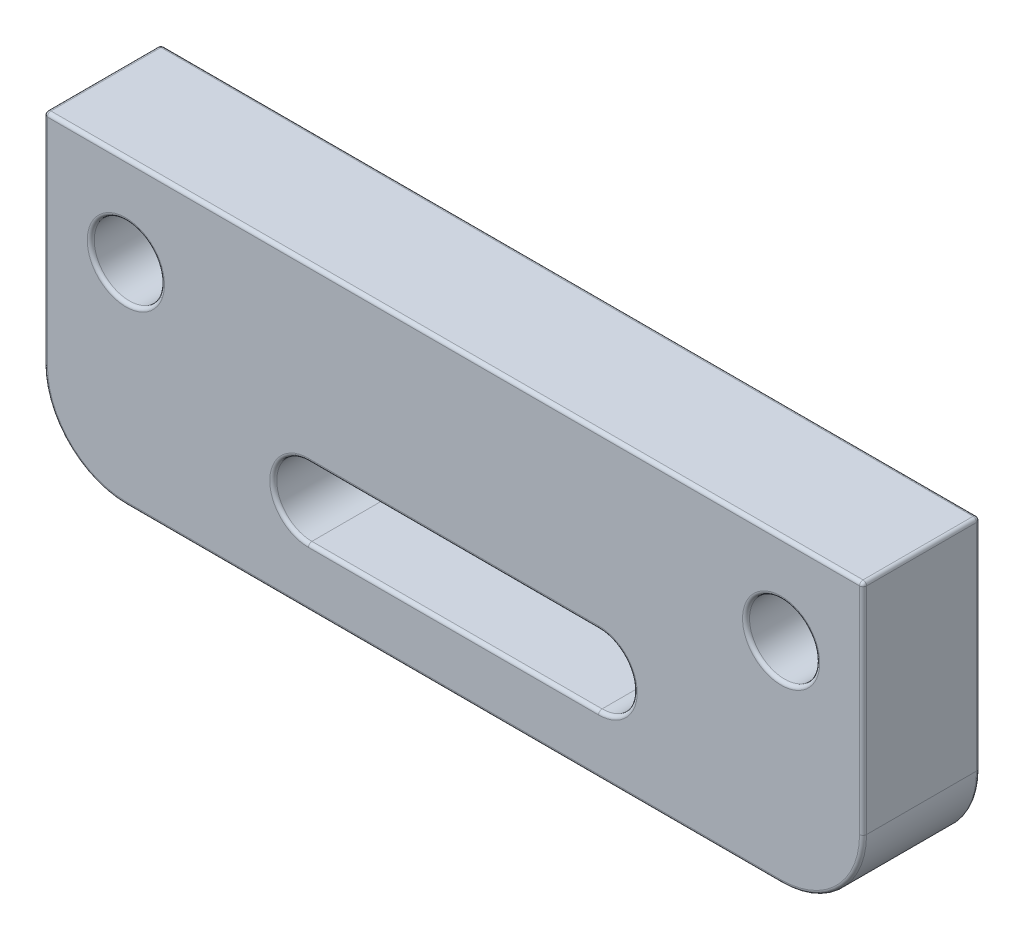
ISO-10303-21;
HEADER;
FILE_DESCRIPTION(('STEP AP214'),'2;1');
FILE_NAME('part.step','',(''),(''),'','','');
FILE_SCHEMA(('AUTOMOTIVE_DESIGN { 1 0 10303 214 1 1 1 1 }'));
ENDSEC;
DATA;
#1=APPLICATION_CONTEXT('core data for automotive mechanical design processes');
#2=APPLICATION_PROTOCOL_DEFINITION('international standard','automotive_design',2000,#1);
#3=PRODUCT_CONTEXT('',#1,'mechanical');
#4=PRODUCT('Part','Part','',(#3));
#5=PRODUCT_RELATED_PRODUCT_CATEGORY('part','',(#4));
#6=PRODUCT_DEFINITION_FORMATION('','',#4);
#7=PRODUCT_DEFINITION_CONTEXT('part definition',#1,'design');
#8=PRODUCT_DEFINITION('design','',#6,#7);
#9=PRODUCT_DEFINITION_SHAPE('','',#8);
#10=(LENGTH_UNIT() NAMED_UNIT(*) SI_UNIT(.MILLI.,.METRE.));
#11=(NAMED_UNIT(*) PLANE_ANGLE_UNIT() SI_UNIT($,.RADIAN.));
#12=(NAMED_UNIT(*) SI_UNIT($,.STERADIAN.) SOLID_ANGLE_UNIT());
#13=UNCERTAINTY_MEASURE_WITH_UNIT(LENGTH_MEASURE(1.E-05),#10,'distance_accuracy_value','');
#14=(GEOMETRIC_REPRESENTATION_CONTEXT(3) GLOBAL_UNCERTAINTY_ASSIGNED_CONTEXT((#13)) GLOBAL_UNIT_ASSIGNED_CONTEXT((#10,
#11,#12)) REPRESENTATION_CONTEXT('',''));
#15=CARTESIAN_POINT('',(0.,0.,0.));
#16=DIRECTION('',(0.,0.,1.));
#17=DIRECTION('',(1.,0.,0.));
#18=AXIS2_PLACEMENT_3D('',#15,#16,#17);
#19=CARTESIAN_POINT('',(-22.35,-6.15,82.5970196391225));
#20=DIRECTION('',(0.,1.,0.));
#21=DIRECTION('',(-1.,0.,0.));
#22=AXIS2_PLACEMENT_3D('',#19,#20,#21);
#23=PLANE('',#22);
#24=DIRECTION('',(-1.,0.,0.));
#25=VECTOR('',#24,1.);
#26=CARTESIAN_POINT('',(-22.35,-6.15,4.85000000000001));
#27=LINE('',#26,#25);
#28=CARTESIAN_POINT('',(-17.35,-6.15,4.85));
#29=VERTEX_POINT('',#28);
#30=CARTESIAN_POINT('',(17.35,-6.15,4.85));
#31=VERTEX_POINT('',#30);
#32=EDGE_CURVE('E416',#29,#31,#27,.F.);
#33=ORIENTED_EDGE('',*,*,#32,.T.);
#34=DIRECTION('',(0.,0.,1.));
#35=VECTOR('',#34,1.);
#36=CARTESIAN_POINT('',(17.35,-6.15,82.5970196391225));
#37=LINE('',#36,#35);
#38=CARTESIAN_POINT('',(17.35,-6.15,0.15));
#39=VERTEX_POINT('',#38);
#40=EDGE_CURVE('E425',#31,#39,#37,.F.);
#41=ORIENTED_EDGE('',*,*,#40,.T.);
#42=DIRECTION('',(1.,0.,0.));
#43=VECTOR('',#42,1.);
#44=CARTESIAN_POINT('',(-17.35,-6.15,0.15));
#45=LINE('',#44,#43);
#46=CARTESIAN_POINT('',(-17.35,-6.15,0.15));
#47=VERTEX_POINT('',#46);
#48=EDGE_CURVE('E422',#39,#47,#45,.F.);
#49=ORIENTED_EDGE('',*,*,#48,.T.);
#50=DIRECTION('',(0.,0.,1.));
#51=VECTOR('',#50,1.);
#52=CARTESIAN_POINT('',(-17.35,-6.15,4.85000000000001));
#53=LINE('',#52,#51);
#54=EDGE_CURVE('E419',#47,#29,#53,.T.);
#55=ORIENTED_EDGE('',*,*,#54,.T.);
#56=EDGE_LOOP('',(#33,#41,#49,#55));
#57=FACE_BOUND('',#56,.T.);
#58=ADVANCED_FACE('F40',(#57),#23,.T.);
#59=CARTESIAN_POINT('',(-17.5,0.,5.));
#60=DIRECTION('',(1.,0.,0.));
#61=DIRECTION('',(0.,1.,0.));
#62=AXIS2_PLACEMENT_3D('',#59,#60,#61);
#63=PLANE('',#62);
#64=DIRECTION('',(0.,-1.,0.));
#65=VECTOR('',#64,1.);
#66=CARTESIAN_POINT('',(-17.5,9.,4.85));
#67=LINE('',#66,#65);
#68=CARTESIAN_POINT('',(-17.5,-15.5,4.85));
#69=VERTEX_POINT('',#68);
#70=CARTESIAN_POINT('',(-17.5,-6.3,4.85));
#71=VERTEX_POINT('',#70);
#72=EDGE_CURVE('E303',#69,#71,#67,.F.);
#73=ORIENTED_EDGE('',*,*,#72,.T.);
#74=DIRECTION('',(0.,0.,1.));
#75=VECTOR('',#74,1.);
#76=CARTESIAN_POINT('',(-17.5,-6.3,0.149999999999997));
#77=LINE('',#76,#75);
#78=CARTESIAN_POINT('',(-17.5,-6.3,0.15));
#79=VERTEX_POINT('',#78);
#80=EDGE_CURVE('E438',#71,#79,#77,.F.);
#81=ORIENTED_EDGE('',*,*,#80,.T.);
#82=DIRECTION('',(0.,-1.,0.));
#83=VECTOR('',#82,1.);
#84=CARTESIAN_POINT('',(-17.5,0.,0.15));
#85=LINE('',#84,#83);
#86=CARTESIAN_POINT('',(-17.5,-15.5,0.15));
#87=VERTEX_POINT('',#86);
#88=EDGE_CURVE('E306',#79,#87,#85,.T.);
#89=ORIENTED_EDGE('',*,*,#88,.T.);
#90=DIRECTION('',(0.,0.,-1.));
#91=VECTOR('',#90,1.);
#92=CARTESIAN_POINT('',(-17.5,-15.5,5.));
#93=LINE('',#92,#91);
#94=EDGE_CURVE('E538',#87,#69,#93,.F.);
#95=ORIENTED_EDGE('',*,*,#94,.T.);
#96=EDGE_LOOP('',(#73,#81,#89,#95));
#97=FACE_BOUND('',#96,.T.);
#98=ADVANCED_FACE('F541',(#97),#63,.F.);
#99=CARTESIAN_POINT('',(17.5,0.,5.));
#100=DIRECTION('',(1.,0.,0.));
#101=DIRECTION('',(0.,1.,0.));
#102=AXIS2_PLACEMENT_3D('',#99,#100,#101);
#103=PLANE('',#102);
#104=DIRECTION('',(0.,-1.,0.));
#105=VECTOR('',#104,1.);
#106=CARTESIAN_POINT('',(17.5,9.00000000000001,0.15));
#107=LINE('',#106,#105);
#108=CARTESIAN_POINT('',(17.5,-15.5,0.15));
#109=VERTEX_POINT('',#108);
#110=CARTESIAN_POINT('',(17.5,-6.3,0.15));
#111=VERTEX_POINT('',#110);
#112=EDGE_CURVE('E299',#109,#111,#107,.F.);
#113=ORIENTED_EDGE('',*,*,#112,.T.);
#114=DIRECTION('',(0.,0.,1.));
#115=VECTOR('',#114,1.);
#116=CARTESIAN_POINT('',(17.5,-6.3,5.));
#117=LINE('',#116,#115);
#118=CARTESIAN_POINT('',(17.5,-6.3,4.85));
#119=VERTEX_POINT('',#118);
#120=EDGE_CURVE('E413',#111,#119,#117,.T.);
#121=ORIENTED_EDGE('',*,*,#120,.T.);
#122=DIRECTION('',(0.,-1.,0.));
#123=VECTOR('',#122,1.);
#124=CARTESIAN_POINT('',(17.5,0.,4.85));
#125=LINE('',#124,#123);
#126=CARTESIAN_POINT('',(17.5,-15.5,4.85));
#127=VERTEX_POINT('',#126);
#128=EDGE_CURVE('E296',#119,#127,#125,.T.);
#129=ORIENTED_EDGE('',*,*,#128,.T.);
#130=DIRECTION('',(0.,0.,-1.));
#131=VECTOR('',#130,1.);
#132=CARTESIAN_POINT('',(17.5,-15.5,0.));
#133=LINE('',#132,#131);
#134=EDGE_CURVE('E214',#127,#109,#133,.T.);
#135=ORIENTED_EDGE('',*,*,#134,.T.);
#136=EDGE_LOOP('',(#113,#121,#129,#135));
#137=FACE_BOUND('',#136,.T.);
#138=ADVANCED_FACE('F577',(#137),#103,.T.);
#139=CARTESIAN_POINT('',(0.,0.,5.));
#140=DIRECTION('',(0.,0.,1.));
#141=DIRECTION('',(1.,0.,0.));
#142=AXIS2_PLACEMENT_3D('',#139,#140,#141);
#143=PLANE('',#142);
#144=CARTESIAN_POINT('',(14.,-9.99999999999997,5.));
#145=DIRECTION('',(0.,0.,1.));
#146=DIRECTION('',(1.,0.,0.));
#147=AXIS2_PLACEMENT_3D('',#144,#145,#146);
#148=CIRCLE('',#147,1.65);
#149=CARTESIAN_POINT('',(15.65,-9.99999999999997,5.));
#150=VERTEX_POINT('',#149);
#151=EDGE_CURVE('E336',#150,#150,#148,.F.);
#152=ORIENTED_EDGE('',*,*,#151,.T.);
#153=EDGE_LOOP('',(#152));
#154=FACE_BOUND('',#153,.T.);
#155=CARTESIAN_POINT('',(-14.,-10.,5.));
#156=DIRECTION('',(0.,0.,1.));
#157=DIRECTION('',(1.,0.,0.));
#158=AXIS2_PLACEMENT_3D('',#155,#156,#157);
#159=CIRCLE('',#158,1.65);
#160=CARTESIAN_POINT('',(-12.35,-10.,5.));
#161=VERTEX_POINT('',#160);
#162=EDGE_CURVE('E340',#161,#161,#159,.F.);
#163=ORIENTED_EDGE('',*,*,#162,.T.);
#164=EDGE_LOOP('',(#163));
#165=FACE_BOUND('',#164,.T.);
#166=CARTESIAN_POINT('',(-6.2,-15.,5.));
#167=DIRECTION('',(0.,0.,1.));
#168=DIRECTION('',(1.,0.,0.));
#169=AXIS2_PLACEMENT_3D('',#166,#167,#168);
#170=CIRCLE('',#169,1.65);
#171=CARTESIAN_POINT('',(-6.2,-16.65,5.));
#172=VERTEX_POINT('',#171);
#173=CARTESIAN_POINT('',(-6.2,-13.35,5.));
#174=VERTEX_POINT('',#173);
#175=EDGE_CURVE('E350',#172,#174,#170,.F.);
#176=ORIENTED_EDGE('',*,*,#175,.T.);
#177=DIRECTION('',(1.,0.,0.));
#178=VECTOR('',#177,1.);
#179=CARTESIAN_POINT('',(6.2,-13.35,5.));
#180=LINE('',#179,#178);
#181=CARTESIAN_POINT('',(6.2,-13.35,5.));
#182=VERTEX_POINT('',#181);
#183=EDGE_CURVE('E353',#174,#182,#180,.T.);
#184=ORIENTED_EDGE('',*,*,#183,.T.);
#185=CARTESIAN_POINT('',(6.2,-15.,5.));
#186=DIRECTION('',(0.,0.,1.));
#187=DIRECTION('',(1.,0.,0.));
#188=AXIS2_PLACEMENT_3D('',#185,#186,#187);
#189=CIRCLE('',#188,1.65);
#190=CARTESIAN_POINT('',(6.20000000000001,-16.65,5.));
#191=VERTEX_POINT('',#190);
#192=EDGE_CURVE('E344',#182,#191,#189,.F.);
#193=ORIENTED_EDGE('',*,*,#192,.T.);
#194=DIRECTION('',(1.,0.,0.));
#195=VECTOR('',#194,1.);
#196=CARTESIAN_POINT('',(0.,-16.65,5.));
#197=LINE('',#196,#195);
#198=EDGE_CURVE('E347',#191,#172,#197,.F.);
#199=ORIENTED_EDGE('',*,*,#198,.T.);
#200=EDGE_LOOP('',(#176,#184,#193,#199));
#201=FACE_BOUND('',#200,.T.);
#202=DIRECTION('',(0.,-1.,0.));
#203=VECTOR('',#202,1.);
#204=CARTESIAN_POINT('',(17.35,0.,5.));
#205=LINE('',#204,#203);
#206=CARTESIAN_POINT('',(17.35,-15.5,5.));
#207=VERTEX_POINT('',#206);
#208=CARTESIAN_POINT('',(17.35,-6.3,5.));
#209=VERTEX_POINT('',#208);
#210=EDGE_CURVE('E333',#207,#209,#205,.F.);
#211=ORIENTED_EDGE('',*,*,#210,.T.);
#212=DIRECTION('',(-1.,0.,0.));
#213=VECTOR('',#212,1.);
#214=CARTESIAN_POINT('',(0.,-6.3,5.));
#215=LINE('',#214,#213);
#216=CARTESIAN_POINT('',(-17.35,-6.3,5.));
#217=VERTEX_POINT('',#216);
#218=EDGE_CURVE('E11',#209,#217,#215,.T.);
#219=ORIENTED_EDGE('',*,*,#218,.T.);
#220=DIRECTION('',(0.,-1.,0.));
#221=VECTOR('',#220,1.);
#222=CARTESIAN_POINT('',(-17.35,-15.5,5.));
#223=LINE('',#222,#221);
#224=CARTESIAN_POINT('',(-17.35,-15.5,5.));
#225=VERTEX_POINT('',#224);
#226=EDGE_CURVE('E321',#217,#225,#223,.T.);
#227=ORIENTED_EDGE('',*,*,#226,.T.);
#228=CARTESIAN_POINT('',(-14.,-15.5,5.));
#229=DIRECTION('',(0.,0.,1.));
#230=DIRECTION('',(1.,0.,0.));
#231=AXIS2_PLACEMENT_3D('',#228,#229,#230);
#232=CIRCLE('',#231,3.35);
#233=CARTESIAN_POINT('',(-14.,-18.85,5.));
#234=VERTEX_POINT('',#233);
#235=EDGE_CURVE('E324',#225,#234,#232,.T.);
#236=ORIENTED_EDGE('',*,*,#235,.T.);
#237=DIRECTION('',(1.,0.,0.));
#238=VECTOR('',#237,1.);
#239=CARTESIAN_POINT('',(14.,-18.85,5.));
#240=LINE('',#239,#238);
#241=CARTESIAN_POINT('',(14.,-18.85,5.));
#242=VERTEX_POINT('',#241);
#243=EDGE_CURVE('E327',#234,#242,#240,.T.);
#244=ORIENTED_EDGE('',*,*,#243,.T.);
#245=CARTESIAN_POINT('',(14.,-15.5,5.));
#246=DIRECTION('',(0.,0.,1.));
#247=DIRECTION('',(1.,0.,0.));
#248=AXIS2_PLACEMENT_3D('',#245,#246,#247);
#249=CIRCLE('',#248,3.35);
#250=EDGE_CURVE('E330',#242,#207,#249,.T.);
#251=ORIENTED_EDGE('',*,*,#250,.T.);
#252=EDGE_LOOP('',(#211,#219,#227,#236,#244,#251));
#253=FACE_BOUND('',#252,.T.);
#254=ADVANCED_FACE('F502',(#154,#165,#201,#253),#143,.T.);
#255=CARTESIAN_POINT('',(0.,0.,0.));
#256=DIRECTION('',(0.,0.,1.));
#257=DIRECTION('',(1.,0.,0.));
#258=AXIS2_PLACEMENT_3D('',#255,#256,#257);
#259=PLANE('',#258);
#260=CARTESIAN_POINT('',(14.,-9.99999999999997,0.));
#261=DIRECTION('',(0.,0.,1.));
#262=DIRECTION('',(1.,0.,0.));
#263=AXIS2_PLACEMENT_3D('',#260,#261,#262);
#264=CIRCLE('',#263,1.65);
#265=CARTESIAN_POINT('',(15.65,-9.99999999999997,0.));
#266=VERTEX_POINT('',#265);
#267=EDGE_CURVE('E222',#266,#266,#264,.T.);
#268=ORIENTED_EDGE('',*,*,#267,.T.);
#269=EDGE_LOOP('',(#268));
#270=FACE_BOUND('',#269,.T.);
#271=CARTESIAN_POINT('',(-14.,-10.,0.));
#272=DIRECTION('',(0.,0.,1.));
#273=DIRECTION('',(1.,0.,0.));
#274=AXIS2_PLACEMENT_3D('',#271,#272,#273);
#275=CIRCLE('',#274,1.65);
#276=CARTESIAN_POINT('',(-12.35,-10.,0.));
#277=VERTEX_POINT('',#276);
#278=EDGE_CURVE('E227',#277,#277,#275,.T.);
#279=ORIENTED_EDGE('',*,*,#278,.T.);
#280=EDGE_LOOP('',(#279));
#281=FACE_BOUND('',#280,.T.);
#282=CARTESIAN_POINT('',(-6.2,-15.,0.));
#283=DIRECTION('',(0.,0.,1.));
#284=DIRECTION('',(1.,0.,0.));
#285=AXIS2_PLACEMENT_3D('',#282,#283,#284);
#286=CIRCLE('',#285,1.65);
#287=CARTESIAN_POINT('',(-6.2,-13.35,0.));
#288=VERTEX_POINT('',#287);
#289=CARTESIAN_POINT('',(-6.2,-16.65,0.));
#290=VERTEX_POINT('',#289);
#291=EDGE_CURVE('E242',#288,#290,#286,.T.);
#292=ORIENTED_EDGE('',*,*,#291,.T.);
#293=DIRECTION('',(1.,0.,0.));
#294=VECTOR('',#293,1.);
#295=CARTESIAN_POINT('',(6.20000000000001,-16.65,0.));
#296=LINE('',#295,#294);
#297=CARTESIAN_POINT('',(6.20000000000001,-16.65,0.));
#298=VERTEX_POINT('',#297);
#299=EDGE_CURVE('E245',#290,#298,#296,.T.);
#300=ORIENTED_EDGE('',*,*,#299,.T.);
#301=CARTESIAN_POINT('',(6.2,-15.,0.));
#302=DIRECTION('',(0.,0.,1.));
#303=DIRECTION('',(1.,0.,0.));
#304=AXIS2_PLACEMENT_3D('',#301,#302,#303);
#305=CIRCLE('',#304,1.65);
#306=CARTESIAN_POINT('',(6.2,-13.35,0.));
#307=VERTEX_POINT('',#306);
#308=EDGE_CURVE('E236',#298,#307,#305,.T.);
#309=ORIENTED_EDGE('',*,*,#308,.T.);
#310=DIRECTION('',(1.,0.,0.));
#311=VECTOR('',#310,1.);
#312=CARTESIAN_POINT('',(0.,-13.35,0.));
#313=LINE('',#312,#311);
#314=EDGE_CURVE('E239',#307,#288,#313,.F.);
#315=ORIENTED_EDGE('',*,*,#314,.T.);
#316=EDGE_LOOP('',(#292,#300,#309,#315));
#317=FACE_BOUND('',#316,.T.);
#318=DIRECTION('',(0.,-1.,0.));
#319=VECTOR('',#318,1.);
#320=CARTESIAN_POINT('',(-17.35,0.,0.));
#321=LINE('',#320,#319);
#322=CARTESIAN_POINT('',(-17.35,-15.5,0.));
#323=VERTEX_POINT('',#322);
#324=CARTESIAN_POINT('',(-17.35,-6.3,0.));
#325=VERTEX_POINT('',#324);
#326=EDGE_CURVE('E229',#323,#325,#321,.F.);
#327=ORIENTED_EDGE('',*,*,#326,.T.);
#328=DIRECTION('',(1.,0.,0.));
#329=VECTOR('',#328,1.);
#330=CARTESIAN_POINT('',(17.35,-6.3,0.));
#331=LINE('',#330,#329);
#332=CARTESIAN_POINT('',(17.35,-6.3,0.));
#333=VERTEX_POINT('',#332);
#334=EDGE_CURVE('E432',#325,#333,#331,.T.);
#335=ORIENTED_EDGE('',*,*,#334,.T.);
#336=DIRECTION('',(0.,-1.,0.));
#337=VECTOR('',#336,1.);
#338=CARTESIAN_POINT('',(17.35,-15.5,0.));
#339=LINE('',#338,#337);
#340=CARTESIAN_POINT('',(17.35,-15.5,0.));
#341=VERTEX_POINT('',#340);
#342=EDGE_CURVE('E219',#333,#341,#339,.T.);
#343=ORIENTED_EDGE('',*,*,#342,.T.);
#344=CARTESIAN_POINT('',(14.,-15.5,0.));
#345=DIRECTION('',(0.,0.,1.));
#346=DIRECTION('',(1.,0.,0.));
#347=AXIS2_PLACEMENT_3D('',#344,#345,#346);
#348=CIRCLE('',#347,3.35);
#349=CARTESIAN_POINT('',(14.,-18.85,0.));
#350=VERTEX_POINT('',#349);
#351=EDGE_CURVE('E196',#341,#350,#348,.F.);
#352=ORIENTED_EDGE('',*,*,#351,.T.);
#353=DIRECTION('',(1.,0.,0.));
#354=VECTOR('',#353,1.);
#355=CARTESIAN_POINT('',(0.,-18.85,0.));
#356=LINE('',#355,#354);
#357=CARTESIAN_POINT('',(-14.,-18.85,0.));
#358=VERTEX_POINT('',#357);
#359=EDGE_CURVE('E206',#350,#358,#356,.F.);
#360=ORIENTED_EDGE('',*,*,#359,.T.);
#361=CARTESIAN_POINT('',(-14.,-15.5,0.));
#362=DIRECTION('',(0.,0.,1.));
#363=DIRECTION('',(1.,0.,0.));
#364=AXIS2_PLACEMENT_3D('',#361,#362,#363);
#365=CIRCLE('',#364,3.35);
#366=EDGE_CURVE('E213',#358,#323,#365,.F.);
#367=ORIENTED_EDGE('',*,*,#366,.T.);
#368=EDGE_LOOP('',(#327,#335,#343,#352,#360,#367));
#369=FACE_BOUND('',#368,.T.);
#370=ADVANCED_FACE('F217',(#270,#281,#317,#369),#259,.F.);
#371=CARTESIAN_POINT('',(-17.35,0.,0.15));
#372=DIRECTION('',(0.,-1.,0.));
#373=DIRECTION('',(1.,0.,0.));
#374=AXIS2_PLACEMENT_3D('',#371,#372,#373);
#375=CYLINDRICAL_SURFACE('',#374,0.15);
#376=ORIENTED_EDGE('',*,*,#88,.F.);
#377=CARTESIAN_POINT('',(-17.35,-6.3,0.15));
#378=DIRECTION('',(0.,-1.,0.));
#379=DIRECTION('',(1.,0.,0.));
#380=AXIS2_PLACEMENT_3D('',#377,#378,#379);
#381=CIRCLE('',#380,0.15);
#382=EDGE_CURVE('E435',#79,#325,#381,.T.);
#383=ORIENTED_EDGE('',*,*,#382,.T.);
#384=ORIENTED_EDGE('',*,*,#326,.F.);
#385=CARTESIAN_POINT('',(-17.35,-15.5,0.15));
#386=DIRECTION('',(0.,-1.,0.));
#387=DIRECTION('',(0.,0.,-1.));
#388=AXIS2_PLACEMENT_3D('',#385,#386,#387);
#389=CIRCLE('',#388,0.15);
#390=EDGE_CURVE('E362',#87,#323,#389,.T.);
#391=ORIENTED_EDGE('',*,*,#390,.F.);
#392=EDGE_LOOP('',(#376,#383,#384,#391));
#393=FACE_BOUND('',#392,.T.);
#394=ADVANCED_FACE('F554',(#393),#375,.T.);
#395=CARTESIAN_POINT('',(17.35,0.,0.15));
#396=DIRECTION('',(0.,1.,0.));
#397=DIRECTION('',(-1.,0.,0.));
#398=AXIS2_PLACEMENT_3D('',#395,#396,#397);
#399=CYLINDRICAL_SURFACE('',#398,0.15);
#400=ORIENTED_EDGE('',*,*,#342,.F.);
#401=CARTESIAN_POINT('',(17.35,-6.3,0.15));
#402=DIRECTION('',(0.,1.,0.));
#403=DIRECTION('',(-1.,0.,0.));
#404=AXIS2_PLACEMENT_3D('',#401,#402,#403);
#405=CIRCLE('',#404,0.15);
#406=EDGE_CURVE('E429',#333,#111,#405,.F.);
#407=ORIENTED_EDGE('',*,*,#406,.T.);
#408=ORIENTED_EDGE('',*,*,#112,.F.);
#409=CARTESIAN_POINT('',(17.35,-15.5,0.15));
#410=DIRECTION('',(0.,-1.,0.));
#411=DIRECTION('',(0.,0.,-1.));
#412=AXIS2_PLACEMENT_3D('',#409,#410,#411);
#413=CIRCLE('',#412,0.15);
#414=EDGE_CURVE('E202',#341,#109,#413,.T.);
#415=ORIENTED_EDGE('',*,*,#414,.F.);
#416=EDGE_LOOP('',(#400,#407,#408,#415));
#417=FACE_BOUND('',#416,.T.);
#418=ADVANCED_FACE('F640',(#417),#399,.T.);
#419=CARTESIAN_POINT('',(-17.35,0.,4.85));
#420=DIRECTION('',(0.,1.,0.));
#421=DIRECTION('',(-1.,0.,0.));
#422=AXIS2_PLACEMENT_3D('',#419,#420,#421);
#423=CYLINDRICAL_SURFACE('',#422,0.15);
#424=ORIENTED_EDGE('',*,*,#226,.F.);
#425=CARTESIAN_POINT('',(-17.35,-6.3,4.85));
#426=DIRECTION('',(0.,1.,0.));
#427=DIRECTION('',(-1.,0.,0.));
#428=AXIS2_PLACEMENT_3D('',#425,#426,#427);
#429=CIRCLE('',#428,0.15);
#430=EDGE_CURVE('E50',#217,#71,#429,.F.);
#431=ORIENTED_EDGE('',*,*,#430,.T.);
#432=ORIENTED_EDGE('',*,*,#72,.F.);
#433=CARTESIAN_POINT('',(-17.35,-15.5,4.85));
#434=DIRECTION('',(0.,1.,0.));
#435=DIRECTION('',(0.,0.,1.));
#436=AXIS2_PLACEMENT_3D('',#433,#434,#435);
#437=CIRCLE('',#436,0.15);
#438=EDGE_CURVE('E399',#69,#225,#437,.T.);
#439=ORIENTED_EDGE('',*,*,#438,.T.);
#440=EDGE_LOOP('',(#424,#431,#432,#439));
#441=FACE_BOUND('',#440,.T.);
#442=ADVANCED_FACE('F642',(#441),#423,.T.);
#443=CARTESIAN_POINT('',(17.35,0.,4.85));
#444=DIRECTION('',(0.,-1.,0.));
#445=DIRECTION('',(1.,0.,0.));
#446=AXIS2_PLACEMENT_3D('',#443,#444,#445);
#447=CYLINDRICAL_SURFACE('',#446,0.15);
#448=ORIENTED_EDGE('',*,*,#128,.F.);
#449=CARTESIAN_POINT('',(17.35,-6.3,4.85));
#450=DIRECTION('',(0.,-1.,0.));
#451=DIRECTION('',(1.,0.,0.));
#452=AXIS2_PLACEMENT_3D('',#449,#450,#451);
#453=CIRCLE('',#452,0.15);
#454=EDGE_CURVE('E357',#119,#209,#453,.T.);
#455=ORIENTED_EDGE('',*,*,#454,.T.);
#456=ORIENTED_EDGE('',*,*,#210,.F.);
#457=CARTESIAN_POINT('',(17.35,-15.5,4.85));
#458=DIRECTION('',(0.,1.,0.));
#459=DIRECTION('',(0.,0.,1.));
#460=AXIS2_PLACEMENT_3D('',#457,#458,#459);
#461=CIRCLE('',#460,0.15);
#462=EDGE_CURVE('E395',#207,#127,#461,.T.);
#463=ORIENTED_EDGE('',*,*,#462,.T.);
#464=EDGE_LOOP('',(#448,#455,#456,#463));
#465=FACE_BOUND('',#464,.T.);
#466=ADVANCED_FACE('F501',(#465),#447,.T.);
#467=CARTESIAN_POINT('',(6.2,-15.,5.));
#468=DIRECTION('',(0.,0.,-1.));
#469=DIRECTION('',(-1.,0.,0.));
#470=AXIS2_PLACEMENT_3D('',#467,#468,#469);
#471=CYLINDRICAL_SURFACE('',#470,1.5);
#472=DIRECTION('',(0.,0.,-1.));
#473=VECTOR('',#472,1.);
#474=CARTESIAN_POINT('',(6.2,-13.5,5.));
#475=LINE('',#474,#473);
#476=CARTESIAN_POINT('',(6.2,-13.5,4.85));
#477=VERTEX_POINT('',#476);
#478=CARTESIAN_POINT('',(6.2,-13.5,0.15));
#479=VERTEX_POINT('',#478);
#480=EDGE_CURVE('E372',#477,#479,#475,.T.);
#481=ORIENTED_EDGE('',*,*,#480,.T.);
#482=CARTESIAN_POINT('',(6.2,-15.,0.15));
#483=DIRECTION('',(0.,0.,1.));
#484=DIRECTION('',(1.,0.,0.));
#485=AXIS2_PLACEMENT_3D('',#482,#483,#484);
#486=CIRCLE('',#485,1.5);
#487=CARTESIAN_POINT('',(6.20000000000001,-16.5,0.15));
#488=VERTEX_POINT('',#487);
#489=EDGE_CURVE('E272',#479,#488,#486,.F.);
#490=ORIENTED_EDGE('',*,*,#489,.T.);
#491=DIRECTION('',(0.,0.,-1.));
#492=VECTOR('',#491,1.);
#493=CARTESIAN_POINT('',(6.20000000000001,-16.5,5.));
#494=LINE('',#493,#492);
#495=CARTESIAN_POINT('',(6.20000000000001,-16.5,4.85));
#496=VERTEX_POINT('',#495);
#497=EDGE_CURVE('E524',#496,#488,#494,.T.);
#498=ORIENTED_EDGE('',*,*,#497,.F.);
#499=CARTESIAN_POINT('',(6.2,-15.,4.85));
#500=DIRECTION('',(0.,0.,1.));
#501=DIRECTION('',(1.,0.,0.));
#502=AXIS2_PLACEMENT_3D('',#499,#500,#501);
#503=CIRCLE('',#502,1.5);
#504=EDGE_CURVE('E269',#496,#477,#503,.T.);
#505=ORIENTED_EDGE('',*,*,#504,.T.);
#506=EDGE_LOOP('',(#481,#490,#498,#505));
#507=FACE_BOUND('',#506,.T.);
#508=ADVANCED_FACE('F598',(#507),#471,.F.);
#509=CARTESIAN_POINT('',(0.,-16.5,5.));
#510=DIRECTION('',(0.,1.,0.));
#511=DIRECTION('',(0.,0.,1.));
#512=AXIS2_PLACEMENT_3D('',#509,#510,#511);
#513=PLANE('',#512);
#514=ORIENTED_EDGE('',*,*,#497,.T.);
#515=DIRECTION('',(1.,0.,0.));
#516=VECTOR('',#515,1.);
#517=CARTESIAN_POINT('',(-6.2,-16.5,0.15));
#518=LINE('',#517,#516);
#519=CARTESIAN_POINT('',(-6.2,-16.5,0.15));
#520=VERTEX_POINT('',#519);
#521=EDGE_CURVE('E252',#488,#520,#518,.F.);
#522=ORIENTED_EDGE('',*,*,#521,.T.);
#523=DIRECTION('',(0.,0.,-1.));
#524=VECTOR('',#523,1.);
#525=CARTESIAN_POINT('',(-6.2,-16.5,5.));
#526=LINE('',#525,#524);
#527=CARTESIAN_POINT('',(-6.2,-16.5,4.85));
#528=VERTEX_POINT('',#527);
#529=EDGE_CURVE('E995',#528,#520,#526,.T.);
#530=ORIENTED_EDGE('',*,*,#529,.F.);
#531=DIRECTION('',(1.,0.,0.));
#532=VECTOR('',#531,1.);
#533=CARTESIAN_POINT('',(0.,-16.5,4.85));
#534=LINE('',#533,#532);
#535=EDGE_CURVE('E249',#528,#496,#534,.T.);
#536=ORIENTED_EDGE('',*,*,#535,.T.);
#537=EDGE_LOOP('',(#514,#522,#530,#536));
#538=FACE_BOUND('',#537,.T.);
#539=ADVANCED_FACE('F594',(#538),#513,.T.);
#540=CARTESIAN_POINT('',(-6.2,-15.,5.));
#541=DIRECTION('',(0.,0.,-1.));
#542=DIRECTION('',(-1.,0.,0.));
#543=AXIS2_PLACEMENT_3D('',#540,#541,#542);
#544=CYLINDRICAL_SURFACE('',#543,1.5);
#545=ORIENTED_EDGE('',*,*,#529,.T.);
#546=CARTESIAN_POINT('',(-6.2,-15.,0.15));
#547=DIRECTION('',(0.,0.,1.));
#548=DIRECTION('',(1.,0.,0.));
#549=AXIS2_PLACEMENT_3D('',#546,#547,#548);
#550=CIRCLE('',#549,1.5);
#551=CARTESIAN_POINT('',(-6.2,-13.5,0.15));
#552=VERTEX_POINT('',#551);
#553=EDGE_CURVE('E259',#520,#552,#550,.F.);
#554=ORIENTED_EDGE('',*,*,#553,.T.);
#555=DIRECTION('',(0.,0.,-1.));
#556=VECTOR('',#555,1.);
#557=CARTESIAN_POINT('',(-6.2,-13.5,5.));
#558=LINE('',#557,#556);
#559=CARTESIAN_POINT('',(-6.2,-13.5,4.85));
#560=VERTEX_POINT('',#559);
#561=EDGE_CURVE('E987',#560,#552,#558,.T.);
#562=ORIENTED_EDGE('',*,*,#561,.F.);
#563=CARTESIAN_POINT('',(-6.2,-15.,4.85));
#564=DIRECTION('',(0.,0.,1.));
#565=DIRECTION('',(1.,0.,0.));
#566=AXIS2_PLACEMENT_3D('',#563,#564,#565);
#567=CIRCLE('',#566,1.5);
#568=EDGE_CURVE('E256',#560,#528,#567,.T.);
#569=ORIENTED_EDGE('',*,*,#568,.T.);
#570=EDGE_LOOP('',(#545,#554,#562,#569));
#571=FACE_BOUND('',#570,.T.);
#572=ADVANCED_FACE('F591',(#571),#544,.F.);
#573=CARTESIAN_POINT('',(0.,-19.,5.));
#574=DIRECTION('',(0.,1.,0.));
#575=DIRECTION('',(-1.,0.,0.));
#576=AXIS2_PLACEMENT_3D('',#573,#574,#575);
#577=PLANE('',#576);
#578=DIRECTION('',(0.,0.,-1.));
#579=VECTOR('',#578,1.);
#580=CARTESIAN_POINT('',(-14.,-19.,5.));
#581=LINE('',#580,#579);
#582=CARTESIAN_POINT('',(-14.,-19.,4.85));
#583=VERTEX_POINT('',#582);
#584=CARTESIAN_POINT('',(-14.,-19.,0.15));
#585=VERTEX_POINT('',#584);
#586=EDGE_CURVE('E523',#583,#585,#581,.T.);
#587=ORIENTED_EDGE('',*,*,#586,.T.);
#588=DIRECTION('',(1.,0.,0.));
#589=VECTOR('',#588,1.);
#590=CARTESIAN_POINT('',(0.,-19.,0.15));
#591=LINE('',#590,#589);
#592=CARTESIAN_POINT('',(14.,-19.,0.15));
#593=VERTEX_POINT('',#592);
#594=EDGE_CURVE('E318',#585,#593,#591,.T.);
#595=ORIENTED_EDGE('',*,*,#594,.T.);
#596=DIRECTION('',(0.,0.,-1.));
#597=VECTOR('',#596,1.);
#598=CARTESIAN_POINT('',(14.,-19.,5.));
#599=LINE('',#598,#597);
#600=CARTESIAN_POINT('',(14.,-19.,4.85));
#601=VERTEX_POINT('',#600);
#602=EDGE_CURVE('E515',#593,#601,#599,.F.);
#603=ORIENTED_EDGE('',*,*,#602,.T.);
#604=DIRECTION('',(1.,0.,0.));
#605=VECTOR('',#604,1.);
#606=CARTESIAN_POINT('',(-14.,-19.,4.85));
#607=LINE('',#606,#605);
#608=EDGE_CURVE('E315',#601,#583,#607,.F.);
#609=ORIENTED_EDGE('',*,*,#608,.T.);
#610=EDGE_LOOP('',(#587,#595,#603,#609));
#611=FACE_BOUND('',#610,.T.);
#612=ADVANCED_FACE('F520',(#611),#577,.F.);
#613=CARTESIAN_POINT('',(0.,-13.5,5.));
#614=DIRECTION('',(0.,1.,0.));
#615=DIRECTION('',(-1.,0.,0.));
#616=AXIS2_PLACEMENT_3D('',#613,#614,#615);
#617=PLANE('',#616);
#618=ORIENTED_EDGE('',*,*,#561,.T.);
#619=DIRECTION('',(1.,0.,0.));
#620=VECTOR('',#619,1.);
#621=CARTESIAN_POINT('',(0.,-13.5,0.15));
#622=LINE('',#621,#620);
#623=EDGE_CURVE('E266',#552,#479,#622,.T.);
#624=ORIENTED_EDGE('',*,*,#623,.T.);
#625=ORIENTED_EDGE('',*,*,#480,.F.);
#626=DIRECTION('',(1.,0.,0.));
#627=VECTOR('',#626,1.);
#628=CARTESIAN_POINT('',(-6.2,-13.5,4.85));
#629=LINE('',#628,#627);
#630=EDGE_CURVE('E262',#477,#560,#629,.F.);
#631=ORIENTED_EDGE('',*,*,#630,.T.);
#632=EDGE_LOOP('',(#618,#624,#625,#631));
#633=FACE_BOUND('',#632,.T.);
#634=ADVANCED_FACE('F586',(#633),#617,.F.);
#635=CARTESIAN_POINT('',(-14.,-10.,5.));
#636=DIRECTION('',(0.,0.,-1.));
#637=DIRECTION('',(-1.,0.,0.));
#638=AXIS2_PLACEMENT_3D('',#635,#636,#637);
#639=CYLINDRICAL_SURFACE('',#638,1.5);
#640=CARTESIAN_POINT('',(-14.,-10.,0.15));
#641=DIRECTION('',(0.,0.,1.));
#642=DIRECTION('',(1.,0.,0.));
#643=AXIS2_PLACEMENT_3D('',#640,#641,#642);
#644=CIRCLE('',#643,1.5);
#645=CARTESIAN_POINT('',(-12.5,-10.,0.15));
#646=VERTEX_POINT('',#645);
#647=EDGE_CURVE('E279',#646,#646,#644,.F.);
#648=ORIENTED_EDGE('',*,*,#647,.T.);
#649=EDGE_LOOP('',(#648));
#650=FACE_BOUND('',#649,.T.);
#651=CARTESIAN_POINT('',(-14.,-10.,4.85));
#652=DIRECTION('',(0.,0.,1.));
#653=DIRECTION('',(1.,0.,0.));
#654=AXIS2_PLACEMENT_3D('',#651,#652,#653);
#655=CIRCLE('',#654,1.5);
#656=CARTESIAN_POINT('',(-12.5,-10.,4.85));
#657=VERTEX_POINT('',#656);
#658=EDGE_CURVE('E275',#657,#657,#655,.T.);
#659=ORIENTED_EDGE('',*,*,#658,.T.);
#660=EDGE_LOOP('',(#659));
#661=FACE_BOUND('',#660,.T.);
#662=ADVANCED_FACE('F589',(#650,#661),#639,.F.);
#663=CARTESIAN_POINT('',(14.,-9.99999999999997,5.));
#664=DIRECTION('',(0.,0.,-1.));
#665=DIRECTION('',(-1.,0.,0.));
#666=AXIS2_PLACEMENT_3D('',#663,#664,#665);
#667=CYLINDRICAL_SURFACE('',#666,1.5);
#668=CARTESIAN_POINT('',(14.,-9.99999999999997,0.15));
#669=DIRECTION('',(0.,0.,1.));
#670=DIRECTION('',(1.,0.,0.));
#671=AXIS2_PLACEMENT_3D('',#668,#669,#670);
#672=CIRCLE('',#671,1.5);
#673=CARTESIAN_POINT('',(15.5,-9.99999999999997,0.15));
#674=VERTEX_POINT('',#673);
#675=EDGE_CURVE('E287',#674,#674,#672,.F.);
#676=ORIENTED_EDGE('',*,*,#675,.T.);
#677=EDGE_LOOP('',(#676));
#678=FACE_BOUND('',#677,.T.);
#679=CARTESIAN_POINT('',(14.,-9.99999999999997,4.85));
#680=DIRECTION('',(0.,0.,1.));
#681=DIRECTION('',(1.,0.,0.));
#682=AXIS2_PLACEMENT_3D('',#679,#680,#681);
#683=CIRCLE('',#682,1.5);
#684=CARTESIAN_POINT('',(15.5,-9.99999999999997,4.85));
#685=VERTEX_POINT('',#684);
#686=EDGE_CURVE('E283',#685,#685,#683,.T.);
#687=ORIENTED_EDGE('',*,*,#686,.T.);
#688=EDGE_LOOP('',(#687));
#689=FACE_BOUND('',#688,.T.);
#690=ADVANCED_FACE('F605',(#678,#689),#667,.F.);
#691=CARTESIAN_POINT('',(-14.,-15.5,5.));
#692=DIRECTION('',(0.,0.,-1.));
#693=DIRECTION('',(-1.,0.,0.));
#694=AXIS2_PLACEMENT_3D('',#691,#692,#693);
#695=CYLINDRICAL_SURFACE('',#694,3.5);
#696=ORIENTED_EDGE('',*,*,#94,.F.);
#697=CARTESIAN_POINT('',(-14.,-15.5,0.15));
#698=DIRECTION('',(0.,0.,1.));
#699=DIRECTION('',(1.,0.,0.));
#700=AXIS2_PLACEMENT_3D('',#697,#698,#699);
#701=CIRCLE('',#700,3.5);
#702=EDGE_CURVE('E312',#87,#585,#701,.T.);
#703=ORIENTED_EDGE('',*,*,#702,.T.);
#704=ORIENTED_EDGE('',*,*,#586,.F.);
#705=CARTESIAN_POINT('',(-14.,-15.5,4.85));
#706=DIRECTION('',(0.,0.,1.));
#707=DIRECTION('',(1.,0.,0.));
#708=AXIS2_PLACEMENT_3D('',#705,#706,#707);
#709=CIRCLE('',#708,3.5);
#710=EDGE_CURVE('E309',#583,#69,#709,.F.);
#711=ORIENTED_EDGE('',*,*,#710,.T.);
#712=EDGE_LOOP('',(#696,#703,#704,#711));
#713=FACE_BOUND('',#712,.T.);
#714=ADVANCED_FACE('F537',(#713),#695,.T.);
#715=CARTESIAN_POINT('',(14.,-15.5,5.));
#716=DIRECTION('',(0.,0.,1.));
#717=DIRECTION('',(1.,0.,0.));
#718=AXIS2_PLACEMENT_3D('',#715,#716,#717);
#719=CYLINDRICAL_SURFACE('',#718,3.5);
#720=ORIENTED_EDGE('',*,*,#602,.F.);
#721=CARTESIAN_POINT('',(14.,-15.5,0.15));
#722=DIRECTION('',(0.,0.,1.));
#723=DIRECTION('',(1.,0.,0.));
#724=AXIS2_PLACEMENT_3D('',#721,#722,#723);
#725=CIRCLE('',#724,3.5);
#726=EDGE_CURVE('E198',#593,#109,#725,.T.);
#727=ORIENTED_EDGE('',*,*,#726,.T.);
#728=ORIENTED_EDGE('',*,*,#134,.F.);
#729=CARTESIAN_POINT('',(14.,-15.5,4.85));
#730=DIRECTION('',(0.,0.,1.));
#731=DIRECTION('',(1.,0.,0.));
#732=AXIS2_PLACEMENT_3D('',#729,#730,#731);
#733=CIRCLE('',#732,3.5);
#734=EDGE_CURVE('E291',#127,#601,#733,.F.);
#735=ORIENTED_EDGE('',*,*,#734,.T.);
#736=EDGE_LOOP('',(#720,#727,#728,#735));
#737=FACE_BOUND('',#736,.T.);
#738=ADVANCED_FACE('F514',(#737),#719,.T.);
#739=CARTESIAN_POINT('',(0.,-13.35,0.15));
#740=DIRECTION('',(1.,0.,0.));
#741=DIRECTION('',(0.,1.,0.));
#742=AXIS2_PLACEMENT_3D('',#739,#740,#741);
#743=CYLINDRICAL_SURFACE('',#742,0.15);
#744=CARTESIAN_POINT('',(6.2,-13.35,0.15));
#745=DIRECTION('',(1.,0.,0.));
#746=DIRECTION('',(0.,0.,-1.));
#747=AXIS2_PLACEMENT_3D('',#744,#745,#746);
#748=CIRCLE('',#747,0.15);
#749=EDGE_CURVE('E365',#479,#307,#748,.T.);
#750=ORIENTED_EDGE('',*,*,#749,.F.);
#751=ORIENTED_EDGE('',*,*,#623,.F.);
#752=CARTESIAN_POINT('',(-6.2,-13.35,0.15));
#753=DIRECTION('',(-1.,0.,0.));
#754=DIRECTION('',(0.,0.,1.));
#755=AXIS2_PLACEMENT_3D('',#752,#753,#754);
#756=CIRCLE('',#755,0.15);
#757=EDGE_CURVE('E369',#288,#552,#756,.T.);
#758=ORIENTED_EDGE('',*,*,#757,.F.);
#759=ORIENTED_EDGE('',*,*,#314,.F.);
#760=EDGE_LOOP('',(#750,#751,#758,#759));
#761=FACE_BOUND('',#760,.T.);
#762=ADVANCED_FACE('F619',(#761),#743,.T.);
#763=CARTESIAN_POINT('',(-6.2,-15.,0.15));
#764=DIRECTION('',(0.,0.,1.));
#765=DIRECTION('',(1.,0.,0.));
#766=AXIS2_PLACEMENT_3D('',#763,#764,#765);
#767=TOROIDAL_SURFACE('',#766,1.65,0.15);
#768=ORIENTED_EDGE('',*,*,#757,.T.);
#769=ORIENTED_EDGE('',*,*,#553,.F.);
#770=CARTESIAN_POINT('',(-6.2,-16.65,0.15));
#771=DIRECTION('',(1.,0.,0.));
#772=DIRECTION('',(0.,0.,-1.));
#773=AXIS2_PLACEMENT_3D('',#770,#771,#772);
#774=CIRCLE('',#773,0.15);
#775=EDGE_CURVE('E361',#290,#520,#774,.T.);
#776=ORIENTED_EDGE('',*,*,#775,.F.);
#777=ORIENTED_EDGE('',*,*,#291,.F.);
#778=EDGE_LOOP('',(#768,#769,#776,#777));
#779=FACE_BOUND('',#778,.T.);
#780=ADVANCED_FACE('F627',(#779),#767,.T.);
#781=CARTESIAN_POINT('',(6.2,-15.,0.15));
#782=DIRECTION('',(0.,0.,1.));
#783=DIRECTION('',(1.,0.,0.));
#784=AXIS2_PLACEMENT_3D('',#781,#782,#783);
#785=TOROIDAL_SURFACE('',#784,1.65,0.15);
#786=ORIENTED_EDGE('',*,*,#749,.T.);
#787=ORIENTED_EDGE('',*,*,#308,.F.);
#788=CARTESIAN_POINT('',(6.20000000000001,-16.65,0.15));
#789=DIRECTION('',(-1.,0.,0.));
#790=DIRECTION('',(0.,0.,1.));
#791=AXIS2_PLACEMENT_3D('',#788,#789,#790);
#792=CIRCLE('',#791,0.15);
#793=EDGE_CURVE('E358',#488,#298,#792,.T.);
#794=ORIENTED_EDGE('',*,*,#793,.F.);
#795=ORIENTED_EDGE('',*,*,#489,.F.);
#796=EDGE_LOOP('',(#786,#787,#794,#795));
#797=FACE_BOUND('',#796,.T.);
#798=ADVANCED_FACE('F623',(#797),#785,.T.);
#799=CARTESIAN_POINT('',(0.,-16.65,0.15));
#800=DIRECTION('',(-1.,0.,0.));
#801=DIRECTION('',(0.,0.,1.));
#802=AXIS2_PLACEMENT_3D('',#799,#800,#801);
#803=CYLINDRICAL_SURFACE('',#802,0.15);
#804=ORIENTED_EDGE('',*,*,#775,.T.);
#805=ORIENTED_EDGE('',*,*,#521,.F.);
#806=ORIENTED_EDGE('',*,*,#793,.T.);
#807=ORIENTED_EDGE('',*,*,#299,.F.);
#808=EDGE_LOOP('',(#804,#805,#806,#807));
#809=FACE_BOUND('',#808,.T.);
#810=ADVANCED_FACE('F620',(#809),#803,.T.);
#811=CARTESIAN_POINT('',(-14.,-10.,0.15));
#812=DIRECTION('',(0.,0.,1.));
#813=DIRECTION('',(1.,0.,0.));
#814=AXIS2_PLACEMENT_3D('',#811,#812,#813);
#815=TOROIDAL_SURFACE('',#814,1.65,0.15);
#816=ORIENTED_EDGE('',*,*,#647,.F.);
#817=EDGE_LOOP('',(#816));
#818=FACE_BOUND('',#817,.T.);
#819=ORIENTED_EDGE('',*,*,#278,.F.);
#820=EDGE_LOOP('',(#819));
#821=FACE_BOUND('',#820,.T.);
#822=ADVANCED_FACE('F566',(#818,#821),#815,.T.);
#823=CARTESIAN_POINT('',(14.,-9.99999999999997,0.15));
#824=DIRECTION('',(0.,0.,1.));
#825=DIRECTION('',(1.,0.,0.));
#826=AXIS2_PLACEMENT_3D('',#823,#824,#825);
#827=TOROIDAL_SURFACE('',#826,1.65,0.15);
#828=ORIENTED_EDGE('',*,*,#267,.F.);
#829=EDGE_LOOP('',(#828));
#830=FACE_BOUND('',#829,.T.);
#831=ORIENTED_EDGE('',*,*,#675,.F.);
#832=EDGE_LOOP('',(#831));
#833=FACE_BOUND('',#832,.T.);
#834=ADVANCED_FACE('F559',(#830,#833),#827,.T.);
#835=CARTESIAN_POINT('',(-14.,-15.5,0.15));
#836=DIRECTION('',(0.,0.,1.));
#837=DIRECTION('',(1.,0.,0.));
#838=AXIS2_PLACEMENT_3D('',#835,#836,#837);
#839=TOROIDAL_SURFACE('',#838,3.35,0.15);
#840=ORIENTED_EDGE('',*,*,#390,.T.);
#841=ORIENTED_EDGE('',*,*,#366,.F.);
#842=CARTESIAN_POINT('',(-14.,-18.85,0.15));
#843=DIRECTION('',(1.,0.,0.));
#844=DIRECTION('',(0.,0.,-1.));
#845=AXIS2_PLACEMENT_3D('',#842,#843,#844);
#846=CIRCLE('',#845,0.15);
#847=EDGE_CURVE('E209',#585,#358,#846,.T.);
#848=ORIENTED_EDGE('',*,*,#847,.F.);
#849=ORIENTED_EDGE('',*,*,#702,.F.);
#850=EDGE_LOOP('',(#840,#841,#848,#849));
#851=FACE_BOUND('',#850,.T.);
#852=ADVANCED_FACE('F557',(#851),#839,.T.);
#853=CARTESIAN_POINT('',(0.,-18.85,0.15));
#854=DIRECTION('',(1.,0.,0.));
#855=DIRECTION('',(0.,1.,0.));
#856=AXIS2_PLACEMENT_3D('',#853,#854,#855);
#857=CYLINDRICAL_SURFACE('',#856,0.15);
#858=ORIENTED_EDGE('',*,*,#847,.T.);
#859=ORIENTED_EDGE('',*,*,#359,.F.);
#860=CARTESIAN_POINT('',(14.,-18.85,0.15));
#861=DIRECTION('',(1.,0.,0.));
#862=DIRECTION('',(0.,0.,-1.));
#863=AXIS2_PLACEMENT_3D('',#860,#861,#862);
#864=CIRCLE('',#863,0.15);
#865=EDGE_CURVE('E192',#593,#350,#864,.T.);
#866=ORIENTED_EDGE('',*,*,#865,.F.);
#867=ORIENTED_EDGE('',*,*,#594,.F.);
#868=EDGE_LOOP('',(#858,#859,#866,#867));
#869=FACE_BOUND('',#868,.T.);
#870=ADVANCED_FACE('F207',(#869),#857,.T.);
#871=CARTESIAN_POINT('',(14.,-15.5,0.15));
#872=DIRECTION('',(0.,0.,1.));
#873=DIRECTION('',(1.,0.,0.));
#874=AXIS2_PLACEMENT_3D('',#871,#872,#873);
#875=TOROIDAL_SURFACE('',#874,3.35,0.15);
#876=ORIENTED_EDGE('',*,*,#414,.T.);
#877=ORIENTED_EDGE('',*,*,#726,.F.);
#878=ORIENTED_EDGE('',*,*,#865,.T.);
#879=ORIENTED_EDGE('',*,*,#351,.F.);
#880=EDGE_LOOP('',(#876,#877,#878,#879));
#881=FACE_BOUND('',#880,.T.);
#882=ADVANCED_FACE('F194',(#881),#875,.T.);
#883=CARTESIAN_POINT('',(0.,-16.65,4.85));
#884=DIRECTION('',(1.,0.,0.));
#885=DIRECTION('',(0.,0.,-1.));
#886=AXIS2_PLACEMENT_3D('',#883,#884,#885);
#887=CYLINDRICAL_SURFACE('',#886,0.15);
#888=CARTESIAN_POINT('',(6.20000000000001,-16.65,4.85));
#889=DIRECTION('',(1.,0.,0.));
#890=DIRECTION('',(0.,0.,-1.));
#891=AXIS2_PLACEMENT_3D('',#888,#889,#890);
#892=CIRCLE('',#891,0.15);
#893=EDGE_CURVE('E388',#496,#191,#892,.T.);
#894=ORIENTED_EDGE('',*,*,#893,.F.);
#895=ORIENTED_EDGE('',*,*,#535,.F.);
#896=CARTESIAN_POINT('',(-6.2,-16.65,4.85));
#897=DIRECTION('',(-1.,0.,0.));
#898=DIRECTION('',(0.,0.,1.));
#899=AXIS2_PLACEMENT_3D('',#896,#897,#898);
#900=CIRCLE('',#899,0.15);
#901=EDGE_CURVE('E203',#172,#528,#900,.T.);
#902=ORIENTED_EDGE('',*,*,#901,.F.);
#903=ORIENTED_EDGE('',*,*,#198,.F.);
#904=EDGE_LOOP('',(#894,#895,#902,#903));
#905=FACE_BOUND('',#904,.T.);
#906=ADVANCED_FACE('F639',(#905),#887,.T.);
#907=CARTESIAN_POINT('',(-6.2,-15.,4.85));
#908=DIRECTION('',(0.,0.,1.));
#909=DIRECTION('',(1.,0.,0.));
#910=AXIS2_PLACEMENT_3D('',#907,#908,#909);
#911=TOROIDAL_SURFACE('',#910,1.65,0.15);
#912=ORIENTED_EDGE('',*,*,#901,.T.);
#913=ORIENTED_EDGE('',*,*,#568,.F.);
#914=CARTESIAN_POINT('',(-6.2,-13.35,4.85));
#915=DIRECTION('',(1.,0.,0.));
#916=DIRECTION('',(0.,0.,-1.));
#917=AXIS2_PLACEMENT_3D('',#914,#915,#916);
#918=CIRCLE('',#917,0.15);
#919=EDGE_CURVE('E384',#174,#560,#918,.T.);
#920=ORIENTED_EDGE('',*,*,#919,.F.);
#921=ORIENTED_EDGE('',*,*,#175,.F.);
#922=EDGE_LOOP('',(#912,#913,#920,#921));
#923=FACE_BOUND('',#922,.T.);
#924=ADVANCED_FACE('F837',(#923),#911,.T.);
#925=CARTESIAN_POINT('',(6.2,-15.,4.85));
#926=DIRECTION('',(0.,0.,1.));
#927=DIRECTION('',(1.,0.,0.));
#928=AXIS2_PLACEMENT_3D('',#925,#926,#927);
#929=TOROIDAL_SURFACE('',#928,1.65,0.15);
#930=ORIENTED_EDGE('',*,*,#893,.T.);
#931=ORIENTED_EDGE('',*,*,#192,.F.);
#932=CARTESIAN_POINT('',(6.2,-13.35,4.85));
#933=DIRECTION('',(-1.,0.,0.));
#934=DIRECTION('',(0.,0.,1.));
#935=AXIS2_PLACEMENT_3D('',#932,#933,#934);
#936=CIRCLE('',#935,0.15);
#937=EDGE_CURVE('E381',#477,#182,#936,.T.);
#938=ORIENTED_EDGE('',*,*,#937,.F.);
#939=ORIENTED_EDGE('',*,*,#504,.F.);
#940=EDGE_LOOP('',(#930,#931,#938,#939));
#941=FACE_BOUND('',#940,.T.);
#942=ADVANCED_FACE('F828',(#941),#929,.T.);
#943=CARTESIAN_POINT('',(0.,-13.35,4.85));
#944=DIRECTION('',(-1.,0.,0.));
#945=DIRECTION('',(0.,-1.,0.));
#946=AXIS2_PLACEMENT_3D('',#943,#944,#945);
#947=CYLINDRICAL_SURFACE('',#946,0.15);
#948=ORIENTED_EDGE('',*,*,#919,.T.);
#949=ORIENTED_EDGE('',*,*,#630,.F.);
#950=ORIENTED_EDGE('',*,*,#937,.T.);
#951=ORIENTED_EDGE('',*,*,#183,.F.);
#952=EDGE_LOOP('',(#948,#949,#950,#951));
#953=FACE_BOUND('',#952,.T.);
#954=ADVANCED_FACE('F819',(#953),#947,.T.);
#955=CARTESIAN_POINT('',(-14.,-10.,4.85));
#956=DIRECTION('',(0.,0.,1.));
#957=DIRECTION('',(1.,0.,0.));
#958=AXIS2_PLACEMENT_3D('',#955,#956,#957);
#959=TOROIDAL_SURFACE('',#958,1.65,0.15);
#960=ORIENTED_EDGE('',*,*,#162,.F.);
#961=EDGE_LOOP('',(#960));
#962=FACE_BOUND('',#961,.T.);
#963=ORIENTED_EDGE('',*,*,#658,.F.);
#964=EDGE_LOOP('',(#963));
#965=FACE_BOUND('',#964,.T.);
#966=ADVANCED_FACE('F810',(#962,#965),#959,.T.);
#967=CARTESIAN_POINT('',(14.,-9.99999999999997,4.85));
#968=DIRECTION('',(0.,0.,1.));
#969=DIRECTION('',(1.,0.,0.));
#970=AXIS2_PLACEMENT_3D('',#967,#968,#969);
#971=TOROIDAL_SURFACE('',#970,1.65,0.15);
#972=ORIENTED_EDGE('',*,*,#686,.F.);
#973=EDGE_LOOP('',(#972));
#974=FACE_BOUND('',#973,.T.);
#975=ORIENTED_EDGE('',*,*,#151,.F.);
#976=EDGE_LOOP('',(#975));
#977=FACE_BOUND('',#976,.T.);
#978=ADVANCED_FACE('F680',(#974,#977),#971,.T.);
#979=CARTESIAN_POINT('',(0.,-18.85,4.85));
#980=DIRECTION('',(-1.,0.,0.));
#981=DIRECTION('',(0.,-1.,0.));
#982=AXIS2_PLACEMENT_3D('',#979,#980,#981);
#983=CYLINDRICAL_SURFACE('',#982,0.15);
#984=CARTESIAN_POINT('',(14.,-18.85,4.85));
#985=DIRECTION('',(1.,0.,0.));
#986=DIRECTION('',(0.,0.,-1.));
#987=AXIS2_PLACEMENT_3D('',#984,#985,#986);
#988=CIRCLE('',#987,0.15);
#989=EDGE_CURVE('E403',#242,#601,#988,.T.);
#990=ORIENTED_EDGE('',*,*,#989,.F.);
#991=ORIENTED_EDGE('',*,*,#243,.F.);
#992=CARTESIAN_POINT('',(-14.,-18.85,4.85));
#993=DIRECTION('',(-1.,0.,0.));
#994=DIRECTION('',(0.,0.,1.));
#995=AXIS2_PLACEMENT_3D('',#992,#993,#994);
#996=CIRCLE('',#995,0.15);
#997=EDGE_CURVE('E385',#583,#234,#996,.T.);
#998=ORIENTED_EDGE('',*,*,#997,.F.);
#999=ORIENTED_EDGE('',*,*,#608,.F.);
#1000=EDGE_LOOP('',(#990,#991,#998,#999));
#1001=FACE_BOUND('',#1000,.T.);
#1002=ADVANCED_FACE('F528',(#1001),#983,.T.);
#1003=CARTESIAN_POINT('',(-14.,-15.5,4.85));
#1004=DIRECTION('',(0.,0.,1.));
#1005=DIRECTION('',(1.,0.,0.));
#1006=AXIS2_PLACEMENT_3D('',#1003,#1004,#1005);
#1007=TOROIDAL_SURFACE('',#1006,3.35,0.15);
#1008=ORIENTED_EDGE('',*,*,#997,.T.);
#1009=ORIENTED_EDGE('',*,*,#235,.F.);
#1010=ORIENTED_EDGE('',*,*,#438,.F.);
#1011=ORIENTED_EDGE('',*,*,#710,.F.);
#1012=EDGE_LOOP('',(#1008,#1009,#1010,#1011));
#1013=FACE_BOUND('',#1012,.T.);
#1014=ADVANCED_FACE('F533',(#1013),#1007,.T.);
#1015=CARTESIAN_POINT('',(14.,-15.5,4.85));
#1016=DIRECTION('',(0.,0.,1.));
#1017=DIRECTION('',(1.,0.,0.));
#1018=AXIS2_PLACEMENT_3D('',#1015,#1016,#1017);
#1019=TOROIDAL_SURFACE('',#1018,3.35,0.15);
#1020=ORIENTED_EDGE('',*,*,#989,.T.);
#1021=ORIENTED_EDGE('',*,*,#734,.F.);
#1022=ORIENTED_EDGE('',*,*,#462,.F.);
#1023=ORIENTED_EDGE('',*,*,#250,.F.);
#1024=EDGE_LOOP('',(#1020,#1021,#1022,#1023));
#1025=FACE_BOUND('',#1024,.T.);
#1026=ADVANCED_FACE('F509',(#1025),#1019,.T.);
#1027=CARTESIAN_POINT('',(-17.35,-6.3,0.15));
#1028=DIRECTION('',(0.,1.,0.));
#1029=DIRECTION('',(-1.,0.,0.));
#1030=AXIS2_PLACEMENT_3D('',#1027,#1028,#1029);
#1031=SPHERICAL_SURFACE('',#1030,0.15);
#1032=CARTESIAN_POINT('',(-17.35,-6.3,0.15));
#1033=DIRECTION('',(0.,0.,1.));
#1034=DIRECTION('',(1.,0.,0.));
#1035=AXIS2_PLACEMENT_3D('',#1032,#1033,#1034);
#1036=CIRCLE('',#1035,0.15);
#1037=EDGE_CURVE('E464',#47,#79,#1036,.T.);
#1038=ORIENTED_EDGE('',*,*,#1037,.F.);
#1039=CARTESIAN_POINT('',(-17.35,-6.3,0.15));
#1040=DIRECTION('',(1.,0.,0.));
#1041=DIRECTION('',(0.,0.,-1.));
#1042=AXIS2_PLACEMENT_3D('',#1039,#1040,#1041);
#1043=CIRCLE('',#1042,0.15);
#1044=EDGE_CURVE('E44',#325,#47,#1043,.T.);
#1045=ORIENTED_EDGE('',*,*,#1044,.F.);
#1046=ORIENTED_EDGE('',*,*,#382,.F.);
#1047=EDGE_LOOP('',(#1038,#1045,#1046));
#1048=FACE_BOUND('',#1047,.T.);
#1049=ADVANCED_FACE('F42',(#1048),#1031,.T.);
#1050=CARTESIAN_POINT('',(0.,-6.3,0.15));
#1051=DIRECTION('',(-1.,0.,0.));
#1052=DIRECTION('',(0.,-1.,0.));
#1053=AXIS2_PLACEMENT_3D('',#1050,#1051,#1052);
#1054=CYLINDRICAL_SURFACE('',#1053,0.15);
#1055=ORIENTED_EDGE('',*,*,#1044,.T.);
#1056=ORIENTED_EDGE('',*,*,#48,.F.);
#1057=CARTESIAN_POINT('',(17.35,-6.3,0.15));
#1058=DIRECTION('',(1.,0.,0.));
#1059=DIRECTION('',(0.,0.,-1.));
#1060=AXIS2_PLACEMENT_3D('',#1057,#1058,#1059);
#1061=CIRCLE('',#1060,0.15);
#1062=EDGE_CURVE('E461',#333,#39,#1061,.T.);
#1063=ORIENTED_EDGE('',*,*,#1062,.F.);
#1064=ORIENTED_EDGE('',*,*,#334,.F.);
#1065=EDGE_LOOP('',(#1055,#1056,#1063,#1064));
#1066=FACE_BOUND('',#1065,.T.);
#1067=ADVANCED_FACE('F477',(#1066),#1054,.T.);
#1068=CARTESIAN_POINT('',(-17.35,-6.3,82.5970196391225));
#1069=DIRECTION('',(0.,0.,-1.));
#1070=DIRECTION('',(-1.,0.,0.));
#1071=AXIS2_PLACEMENT_3D('',#1068,#1069,#1070);
#1072=CYLINDRICAL_SURFACE('',#1071,0.15);
#1073=ORIENTED_EDGE('',*,*,#1037,.T.);
#1074=ORIENTED_EDGE('',*,*,#80,.F.);
#1075=CARTESIAN_POINT('',(-17.35,-6.3,4.85));
#1076=DIRECTION('',(0.,0.,1.));
#1077=DIRECTION('',(1.,0.,0.));
#1078=AXIS2_PLACEMENT_3D('',#1075,#1076,#1077);
#1079=CIRCLE('',#1078,0.15);
#1080=EDGE_CURVE('E457',#29,#71,#1079,.T.);
#1081=ORIENTED_EDGE('',*,*,#1080,.F.);
#1082=ORIENTED_EDGE('',*,*,#54,.F.);
#1083=EDGE_LOOP('',(#1073,#1074,#1081,#1082));
#1084=FACE_BOUND('',#1083,.T.);
#1085=ADVANCED_FACE('F482',(#1084),#1072,.T.);
#1086=CARTESIAN_POINT('',(17.35,-6.3,0.15));
#1087=DIRECTION('',(0.,1.,0.));
#1088=DIRECTION('',(-1.,0.,0.));
#1089=AXIS2_PLACEMENT_3D('',#1086,#1087,#1088);
#1090=SPHERICAL_SURFACE('',#1089,0.15);
#1091=ORIENTED_EDGE('',*,*,#406,.F.);
#1092=ORIENTED_EDGE('',*,*,#1062,.T.);
#1093=CARTESIAN_POINT('',(17.35,-6.3,0.15));
#1094=DIRECTION('',(0.,0.,1.));
#1095=DIRECTION('',(1.,0.,0.));
#1096=AXIS2_PLACEMENT_3D('',#1093,#1094,#1095);
#1097=CIRCLE('',#1096,0.15);
#1098=EDGE_CURVE('E454',#111,#39,#1097,.T.);
#1099=ORIENTED_EDGE('',*,*,#1098,.F.);
#1100=EDGE_LOOP('',(#1091,#1092,#1099));
#1101=FACE_BOUND('',#1100,.T.);
#1102=ADVANCED_FACE('F652',(#1101),#1090,.T.);
#1103=CARTESIAN_POINT('',(-17.35,-6.3,4.85));
#1104=DIRECTION('',(0.,1.,0.));
#1105=DIRECTION('',(-1.,0.,0.));
#1106=AXIS2_PLACEMENT_3D('',#1103,#1104,#1105);
#1107=SPHERICAL_SURFACE('',#1106,0.15);
#1108=ORIENTED_EDGE('',*,*,#1080,.T.);
#1109=ORIENTED_EDGE('',*,*,#430,.F.);
#1110=CARTESIAN_POINT('',(-17.35,-6.3,4.85));
#1111=DIRECTION('',(1.,0.,0.));
#1112=DIRECTION('',(0.,0.,-1.));
#1113=AXIS2_PLACEMENT_3D('',#1110,#1111,#1112);
#1114=CIRCLE('',#1113,0.15);
#1115=EDGE_CURVE('E450',#29,#217,#1114,.T.);
#1116=ORIENTED_EDGE('',*,*,#1115,.F.);
#1117=EDGE_LOOP('',(#1108,#1109,#1116));
#1118=FACE_BOUND('',#1117,.T.);
#1119=ADVANCED_FACE('F654',(#1118),#1107,.T.);
#1120=CARTESIAN_POINT('',(17.35,-6.3,5.));
#1121=DIRECTION('',(0.,0.,1.));
#1122=DIRECTION('',(1.,0.,0.));
#1123=AXIS2_PLACEMENT_3D('',#1120,#1121,#1122);
#1124=CYLINDRICAL_SURFACE('',#1123,0.15);
#1125=ORIENTED_EDGE('',*,*,#1098,.T.);
#1126=ORIENTED_EDGE('',*,*,#40,.F.);
#1127=CARTESIAN_POINT('',(17.35,-6.3,4.85));
#1128=DIRECTION('',(0.,0.,1.));
#1129=DIRECTION('',(1.,0.,0.));
#1130=AXIS2_PLACEMENT_3D('',#1127,#1128,#1129);
#1131=CIRCLE('',#1130,0.15);
#1132=EDGE_CURVE('E446',#119,#31,#1131,.T.);
#1133=ORIENTED_EDGE('',*,*,#1132,.F.);
#1134=ORIENTED_EDGE('',*,*,#120,.F.);
#1135=EDGE_LOOP('',(#1125,#1126,#1133,#1134));
#1136=FACE_BOUND('',#1135,.T.);
#1137=ADVANCED_FACE('F489',(#1136),#1124,.T.);
#1138=CARTESIAN_POINT('',(0.,-6.3,4.85));
#1139=DIRECTION('',(-1.,0.,0.));
#1140=DIRECTION('',(0.,-1.,0.));
#1141=AXIS2_PLACEMENT_3D('',#1138,#1139,#1140);
#1142=CYLINDRICAL_SURFACE('',#1141,0.15);
#1143=ORIENTED_EDGE('',*,*,#1115,.T.);
#1144=ORIENTED_EDGE('',*,*,#218,.F.);
#1145=CARTESIAN_POINT('',(17.35,-6.3,4.85));
#1146=DIRECTION('',(1.,0.,0.));
#1147=DIRECTION('',(0.,0.,-1.));
#1148=AXIS2_PLACEMENT_3D('',#1145,#1146,#1147);
#1149=CIRCLE('',#1148,0.15);
#1150=EDGE_CURVE('E443',#31,#209,#1149,.T.);
#1151=ORIENTED_EDGE('',*,*,#1150,.F.);
#1152=ORIENTED_EDGE('',*,*,#32,.F.);
#1153=EDGE_LOOP('',(#1143,#1144,#1151,#1152));
#1154=FACE_BOUND('',#1153,.T.);
#1155=ADVANCED_FACE('F497',(#1154),#1142,.T.);
#1156=CARTESIAN_POINT('',(17.35,-6.3,4.85));
#1157=DIRECTION('',(0.,1.,0.));
#1158=DIRECTION('',(-1.,0.,0.));
#1159=AXIS2_PLACEMENT_3D('',#1156,#1157,#1158);
#1160=SPHERICAL_SURFACE('',#1159,0.15);
#1161=ORIENTED_EDGE('',*,*,#454,.F.);
#1162=ORIENTED_EDGE('',*,*,#1132,.T.);
#1163=ORIENTED_EDGE('',*,*,#1150,.T.);
#1164=EDGE_LOOP('',(#1161,#1162,#1163));
#1165=FACE_BOUND('',#1164,.T.);
#1166=ADVANCED_FACE('F495',(#1165),#1160,.T.);
#1167=CLOSED_SHELL('',(#58,#98,#138,#254,#370,#394,#418,#442,#466,#508,#539,#572,#612,#634,#662,
#690,#714,#738,#762,#780,#798,#810,#822,#834,#852,#870,#882,#906,#924,#942,#954,#966,#978,#1002,
#1014,#1026,#1049,#1067,#1085,#1102,#1119,#1137,#1155,#1166));
#1168=MANIFOLD_SOLID_BREP('B2',#1167);
#1169=ADVANCED_BREP_SHAPE_REPRESENTATION('',(#18,#1168),#14);
#1170=SHAPE_DEFINITION_REPRESENTATION(#9,#1169);
ENDSEC;
END-ISO-10303-21;
